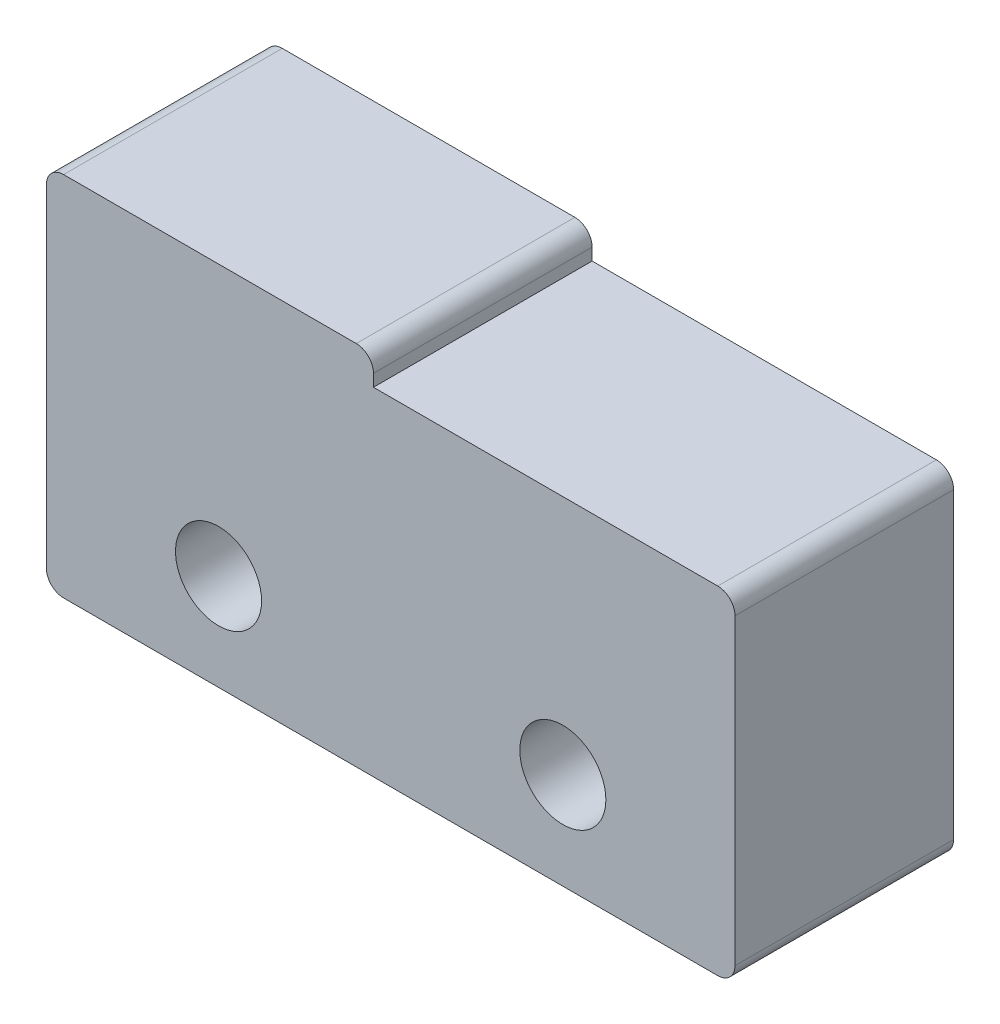
ISO-10303-21;
HEADER;
FILE_DESCRIPTION(('STEP AP214'),'2;1');
FILE_NAME('part.step','',(''),(''),'','','');
FILE_SCHEMA(('AUTOMOTIVE_DESIGN { 1 0 10303 214 1 1 1 1 }'));
ENDSEC;
DATA;
#1=APPLICATION_CONTEXT('core data for automotive mechanical design processes');
#2=APPLICATION_PROTOCOL_DEFINITION('international standard','automotive_design',2000,#1);
#3=PRODUCT_CONTEXT('',#1,'mechanical');
#4=PRODUCT('Part','Part','',(#3));
#5=PRODUCT_RELATED_PRODUCT_CATEGORY('part','',(#4));
#6=PRODUCT_DEFINITION_FORMATION('','',#4);
#7=PRODUCT_DEFINITION_CONTEXT('part definition',#1,'design');
#8=PRODUCT_DEFINITION('design','',#6,#7);
#9=PRODUCT_DEFINITION_SHAPE('','',#8);
#10=(LENGTH_UNIT() NAMED_UNIT(*) SI_UNIT(.MILLI.,.METRE.));
#11=(NAMED_UNIT(*) PLANE_ANGLE_UNIT() SI_UNIT($,.RADIAN.));
#12=(NAMED_UNIT(*) SI_UNIT($,.STERADIAN.) SOLID_ANGLE_UNIT());
#13=UNCERTAINTY_MEASURE_WITH_UNIT(LENGTH_MEASURE(1.E-05),#10,'distance_accuracy_value','');
#14=(GEOMETRIC_REPRESENTATION_CONTEXT(3) GLOBAL_UNCERTAINTY_ASSIGNED_CONTEXT((#13)) GLOBAL_UNIT_ASSIGNED_CONTEXT((#10,
#11,#12)) REPRESENTATION_CONTEXT('',''));
#15=CARTESIAN_POINT('',(0.,0.,0.));
#16=DIRECTION('',(0.,0.,1.));
#17=DIRECTION('',(1.,0.,0.));
#18=AXIS2_PLACEMENT_3D('',#15,#16,#17);
#19=CARTESIAN_POINT('',(0.,0.,6.35));
#20=DIRECTION('',(0.,0.,-1.));
#21=DIRECTION('',(-1.,0.,0.));
#22=AXIS2_PLACEMENT_3D('',#19,#20,#21);
#23=PLANE('',#22);
#24=CARTESIAN_POINT('',(-5.,-2.2,6.35));
#25=DIRECTION('',(0.,0.,1.));
#26=DIRECTION('',(1.,0.,0.));
#27=AXIS2_PLACEMENT_3D('',#24,#25,#26);
#28=CIRCLE('',#27,1.25);
#29=CARTESIAN_POINT('',(-3.75,-2.2,6.35));
#30=VERTEX_POINT('',#29);
#31=EDGE_CURVE('E149',#30,#30,#28,.T.);
#32=ORIENTED_EDGE('',*,*,#31,.F.);
#33=EDGE_LOOP('',(#32));
#34=FACE_BOUND('',#33,.T.);
#35=DIRECTION('',(1.,0.,0.));
#36=VECTOR('',#35,1.);
#37=CARTESIAN_POINT('',(10.,-5.,6.35));
#38=LINE('',#37,#36);
#39=CARTESIAN_POINT('',(-9.5,-5.,6.35));
#40=VERTEX_POINT('',#39);
#41=CARTESIAN_POINT('',(9.5,-5.,6.35));
#42=VERTEX_POINT('',#41);
#43=EDGE_CURVE('E216',#40,#42,#38,.T.);
#44=ORIENTED_EDGE('',*,*,#43,.T.);
#45=CARTESIAN_POINT('',(9.5,-4.5,6.35));
#46=DIRECTION('',(0.,0.,-1.));
#47=DIRECTION('',(-1.,0.,0.));
#48=AXIS2_PLACEMENT_3D('',#45,#46,#47);
#49=CIRCLE('',#48,0.5);
#50=CARTESIAN_POINT('',(10.,-4.5,6.35));
#51=VERTEX_POINT('',#50);
#52=EDGE_CURVE('E186',#42,#51,#49,.F.);
#53=ORIENTED_EDGE('',*,*,#52,.T.);
#54=DIRECTION('',(0.,1.,0.));
#55=VECTOR('',#54,1.);
#56=CARTESIAN_POINT('',(10.,4.8,6.35));
#57=LINE('',#56,#55);
#58=CARTESIAN_POINT('',(10.,4.3,6.35));
#59=VERTEX_POINT('',#58);
#60=EDGE_CURVE('E126',#51,#59,#57,.T.);
#61=ORIENTED_EDGE('',*,*,#60,.T.);
#62=CARTESIAN_POINT('',(9.5,4.3,6.35));
#63=DIRECTION('',(0.,0.,-1.));
#64=DIRECTION('',(-1.,0.,0.));
#65=AXIS2_PLACEMENT_3D('',#62,#63,#64);
#66=CIRCLE('',#65,0.5);
#67=CARTESIAN_POINT('',(9.5,4.8,6.35));
#68=VERTEX_POINT('',#67);
#69=EDGE_CURVE('E122',#59,#68,#66,.F.);
#70=ORIENTED_EDGE('',*,*,#69,.T.);
#71=DIRECTION('',(-1.,0.,0.));
#72=VECTOR('',#71,1.);
#73=CARTESIAN_POINT('',(10.,4.8,6.35));
#74=LINE('',#73,#72);
#75=CARTESIAN_POINT('',(-0.5,4.8,6.35));
#76=VERTEX_POINT('',#75);
#77=EDGE_CURVE('E114',#68,#76,#74,.T.);
#78=ORIENTED_EDGE('',*,*,#77,.T.);
#79=DIRECTION('',(0.,1.,0.));
#80=VECTOR('',#79,1.);
#81=CARTESIAN_POINT('',(-0.5,5.65,6.35));
#82=LINE('',#81,#80);
#83=CARTESIAN_POINT('',(-0.5,5.15,6.35));
#84=VERTEX_POINT('',#83);
#85=EDGE_CURVE('E119',#76,#84,#82,.T.);
#86=ORIENTED_EDGE('',*,*,#85,.T.);
#87=CARTESIAN_POINT('',(-1.,5.15,6.35));
#88=DIRECTION('',(0.,0.,-1.));
#89=DIRECTION('',(-1.,0.,0.));
#90=AXIS2_PLACEMENT_3D('',#87,#88,#89);
#91=CIRCLE('',#90,0.5);
#92=CARTESIAN_POINT('',(-1.,5.65,6.35));
#93=VERTEX_POINT('',#92);
#94=EDGE_CURVE('E54',#84,#93,#91,.F.);
#95=ORIENTED_EDGE('',*,*,#94,.T.);
#96=DIRECTION('',(-1.,0.,0.));
#97=VECTOR('',#96,1.);
#98=CARTESIAN_POINT('',(-0.5,5.65,6.35));
#99=LINE('',#98,#97);
#100=CARTESIAN_POINT('',(-9.5,5.65,6.35));
#101=VERTEX_POINT('',#100);
#102=EDGE_CURVE('E137',#93,#101,#99,.T.);
#103=ORIENTED_EDGE('',*,*,#102,.T.);
#104=CARTESIAN_POINT('',(-9.5,5.15,6.35));
#105=DIRECTION('',(0.,0.,-1.));
#106=DIRECTION('',(-1.,0.,0.));
#107=AXIS2_PLACEMENT_3D('',#104,#105,#106);
#108=CIRCLE('',#107,0.5);
#109=CARTESIAN_POINT('',(-10.,5.15,6.35));
#110=VERTEX_POINT('',#109);
#111=EDGE_CURVE('E181',#101,#110,#108,.F.);
#112=ORIENTED_EDGE('',*,*,#111,.T.);
#113=DIRECTION('',(0.,-1.,0.));
#114=VECTOR('',#113,1.);
#115=CARTESIAN_POINT('',(-10.,5.65,6.35));
#116=LINE('',#115,#114);
#117=CARTESIAN_POINT('',(-10.,-4.5,6.35));
#118=VERTEX_POINT('',#117);
#119=EDGE_CURVE('E159',#110,#118,#116,.T.);
#120=ORIENTED_EDGE('',*,*,#119,.T.);
#121=CARTESIAN_POINT('',(-9.5,-4.5,6.35));
#122=DIRECTION('',(0.,0.,-1.));
#123=DIRECTION('',(-1.,0.,0.));
#124=AXIS2_PLACEMENT_3D('',#121,#122,#123);
#125=CIRCLE('',#124,0.5);
#126=EDGE_CURVE('E183',#118,#40,#125,.F.);
#127=ORIENTED_EDGE('',*,*,#126,.T.);
#128=EDGE_LOOP('',(#44,#53,#61,#70,#78,#86,#95,#103,#112,#120,#127));
#129=FACE_BOUND('',#128,.T.);
#130=CARTESIAN_POINT('',(5.,-2.2,6.35));
#131=DIRECTION('',(0.,0.,1.));
#132=DIRECTION('',(1.,0.,0.));
#133=AXIS2_PLACEMENT_3D('',#130,#131,#132);
#134=CIRCLE('',#133,1.25);
#135=CARTESIAN_POINT('',(6.25,-2.2,6.35));
#136=VERTEX_POINT('',#135);
#137=EDGE_CURVE('E369',#136,#136,#134,.T.);
#138=ORIENTED_EDGE('',*,*,#137,.F.);
#139=EDGE_LOOP('',(#138));
#140=FACE_BOUND('',#139,.T.);
#141=ADVANCED_FACE('F33',(#34,#129,#140),#23,.F.);
#142=CARTESIAN_POINT('',(0.,0.,0.));
#143=DIRECTION('',(0.,0.,-1.));
#144=DIRECTION('',(-1.,0.,0.));
#145=AXIS2_PLACEMENT_3D('',#142,#143,#144);
#146=PLANE('',#145);
#147=CARTESIAN_POINT('',(-5.,-2.2,0.));
#148=DIRECTION('',(0.,0.,1.));
#149=DIRECTION('',(1.,0.,0.));
#150=AXIS2_PLACEMENT_3D('',#147,#148,#149);
#151=CIRCLE('',#150,1.25);
#152=CARTESIAN_POINT('',(-3.75,-2.2,0.));
#153=VERTEX_POINT('',#152);
#154=EDGE_CURVE('E220',#153,#153,#151,.T.);
#155=ORIENTED_EDGE('',*,*,#154,.T.);
#156=EDGE_LOOP('',(#155));
#157=FACE_BOUND('',#156,.T.);
#158=DIRECTION('',(0.,1.,0.));
#159=VECTOR('',#158,1.);
#160=CARTESIAN_POINT('',(10.,4.8,0.));
#161=LINE('',#160,#159);
#162=CARTESIAN_POINT('',(10.,-4.5,0.));
#163=VERTEX_POINT('',#162);
#164=CARTESIAN_POINT('',(10.,4.3,0.));
#165=VERTEX_POINT('',#164);
#166=EDGE_CURVE('E152',#163,#165,#161,.T.);
#167=ORIENTED_EDGE('',*,*,#166,.F.);
#168=CARTESIAN_POINT('',(9.5,-4.5,0.));
#169=DIRECTION('',(0.,0.,-1.));
#170=DIRECTION('',(-1.,0.,0.));
#171=AXIS2_PLACEMENT_3D('',#168,#169,#170);
#172=CIRCLE('',#171,0.5);
#173=CARTESIAN_POINT('',(9.5,-5.,0.));
#174=VERTEX_POINT('',#173);
#175=EDGE_CURVE('E173',#163,#174,#172,.T.);
#176=ORIENTED_EDGE('',*,*,#175,.T.);
#177=DIRECTION('',(1.,0.,0.));
#178=VECTOR('',#177,1.);
#179=CARTESIAN_POINT('',(10.,-5.,0.));
#180=LINE('',#179,#178);
#181=CARTESIAN_POINT('',(-9.5,-5.,0.));
#182=VERTEX_POINT('',#181);
#183=EDGE_CURVE('E148',#182,#174,#180,.T.);
#184=ORIENTED_EDGE('',*,*,#183,.F.);
#185=CARTESIAN_POINT('',(-9.5,-4.5,0.));
#186=DIRECTION('',(0.,0.,-1.));
#187=DIRECTION('',(-1.,0.,0.));
#188=AXIS2_PLACEMENT_3D('',#185,#186,#187);
#189=CIRCLE('',#188,0.5);
#190=CARTESIAN_POINT('',(-10.,-4.5,0.));
#191=VERTEX_POINT('',#190);
#192=EDGE_CURVE('E169',#182,#191,#189,.T.);
#193=ORIENTED_EDGE('',*,*,#192,.T.);
#194=DIRECTION('',(0.,-1.,0.));
#195=VECTOR('',#194,1.);
#196=CARTESIAN_POINT('',(-10.,5.65,0.));
#197=LINE('',#196,#195);
#198=CARTESIAN_POINT('',(-10.,5.15,0.));
#199=VERTEX_POINT('',#198);
#200=EDGE_CURVE('E145',#199,#191,#197,.T.);
#201=ORIENTED_EDGE('',*,*,#200,.F.);
#202=CARTESIAN_POINT('',(-9.5,5.15,0.));
#203=DIRECTION('',(0.,0.,-1.));
#204=DIRECTION('',(-1.,0.,0.));
#205=AXIS2_PLACEMENT_3D('',#202,#203,#204);
#206=CIRCLE('',#205,0.5);
#207=CARTESIAN_POINT('',(-9.5,5.65,0.));
#208=VERTEX_POINT('',#207);
#209=EDGE_CURVE('E167',#199,#208,#206,.T.);
#210=ORIENTED_EDGE('',*,*,#209,.T.);
#211=DIRECTION('',(-1.,0.,0.));
#212=VECTOR('',#211,1.);
#213=CARTESIAN_POINT('',(-0.5,5.65,0.));
#214=LINE('',#213,#212);
#215=CARTESIAN_POINT('',(-1.,5.65,0.));
#216=VERTEX_POINT('',#215);
#217=EDGE_CURVE('E158',#216,#208,#214,.T.);
#218=ORIENTED_EDGE('',*,*,#217,.F.);
#219=CARTESIAN_POINT('',(-1.,5.15,0.));
#220=DIRECTION('',(0.,0.,-1.));
#221=DIRECTION('',(-1.,0.,0.));
#222=AXIS2_PLACEMENT_3D('',#219,#220,#221);
#223=CIRCLE('',#222,0.5);
#224=CARTESIAN_POINT('',(-0.5,5.15,0.));
#225=VERTEX_POINT('',#224);
#226=EDGE_CURVE('E165',#216,#225,#223,.T.);
#227=ORIENTED_EDGE('',*,*,#226,.T.);
#228=DIRECTION('',(0.,1.,0.));
#229=VECTOR('',#228,1.);
#230=CARTESIAN_POINT('',(-0.5,5.65,0.));
#231=LINE('',#230,#229);
#232=CARTESIAN_POINT('',(-0.5,4.8,0.));
#233=VERTEX_POINT('',#232);
#234=EDGE_CURVE('E156',#233,#225,#231,.T.);
#235=ORIENTED_EDGE('',*,*,#234,.F.);
#236=DIRECTION('',(-1.,0.,0.));
#237=VECTOR('',#236,1.);
#238=CARTESIAN_POINT('',(10.,4.8,0.));
#239=LINE('',#238,#237);
#240=CARTESIAN_POINT('',(9.5,4.8,0.));
#241=VERTEX_POINT('',#240);
#242=EDGE_CURVE('E132',#241,#233,#239,.T.);
#243=ORIENTED_EDGE('',*,*,#242,.F.);
#244=CARTESIAN_POINT('',(9.5,4.3,0.));
#245=DIRECTION('',(0.,0.,-1.));
#246=DIRECTION('',(-1.,0.,0.));
#247=AXIS2_PLACEMENT_3D('',#244,#245,#246);
#248=CIRCLE('',#247,0.5);
#249=EDGE_CURVE('E171',#241,#165,#248,.T.);
#250=ORIENTED_EDGE('',*,*,#249,.T.);
#251=EDGE_LOOP('',(#167,#176,#184,#193,#201,#210,#218,#227,#235,#243,#250));
#252=FACE_BOUND('',#251,.T.);
#253=CARTESIAN_POINT('',(5.,-2.2,0.));
#254=DIRECTION('',(0.,0.,1.));
#255=DIRECTION('',(1.,0.,0.));
#256=AXIS2_PLACEMENT_3D('',#253,#254,#255);
#257=CIRCLE('',#256,1.25);
#258=CARTESIAN_POINT('',(6.25,-2.2,0.));
#259=VERTEX_POINT('',#258);
#260=EDGE_CURVE('E371',#259,#259,#257,.T.);
#261=ORIENTED_EDGE('',*,*,#260,.T.);
#262=EDGE_LOOP('',(#261));
#263=FACE_BOUND('',#262,.T.);
#264=ADVANCED_FACE('F203',(#157,#252,#263),#146,.T.);
#265=CARTESIAN_POINT('',(-10.,5.65,6.35));
#266=DIRECTION('',(1.,0.,0.));
#267=DIRECTION('',(0.,0.,-1.));
#268=AXIS2_PLACEMENT_3D('',#265,#266,#267);
#269=PLANE('',#268);
#270=ORIENTED_EDGE('',*,*,#200,.T.);
#271=DIRECTION('',(0.,0.,-1.));
#272=VECTOR('',#271,1.);
#273=CARTESIAN_POINT('',(-10.,-4.5,6.35));
#274=LINE('',#273,#272);
#275=EDGE_CURVE('E193',#191,#118,#274,.F.);
#276=ORIENTED_EDGE('',*,*,#275,.T.);
#277=ORIENTED_EDGE('',*,*,#119,.F.);
#278=DIRECTION('',(0.,0.,-1.));
#279=VECTOR('',#278,1.);
#280=CARTESIAN_POINT('',(-10.,5.15,6.35));
#281=LINE('',#280,#279);
#282=EDGE_CURVE('E190',#110,#199,#281,.T.);
#283=ORIENTED_EDGE('',*,*,#282,.T.);
#284=EDGE_LOOP('',(#270,#276,#277,#283));
#285=FACE_BOUND('',#284,.T.);
#286=ADVANCED_FACE('F212',(#285),#269,.F.);
#287=CARTESIAN_POINT('',(10.,-5.,6.35));
#288=DIRECTION('',(0.,1.,0.));
#289=DIRECTION('',(-1.,0.,0.));
#290=AXIS2_PLACEMENT_3D('',#287,#288,#289);
#291=PLANE('',#290);
#292=ORIENTED_EDGE('',*,*,#183,.T.);
#293=DIRECTION('',(0.,0.,-1.));
#294=VECTOR('',#293,1.);
#295=CARTESIAN_POINT('',(9.5,-5.,6.35));
#296=LINE('',#295,#294);
#297=EDGE_CURVE('E178',#174,#42,#296,.F.);
#298=ORIENTED_EDGE('',*,*,#297,.T.);
#299=ORIENTED_EDGE('',*,*,#43,.F.);
#300=DIRECTION('',(0.,0.,-1.));
#301=VECTOR('',#300,1.);
#302=CARTESIAN_POINT('',(-9.5,-5.,6.35));
#303=LINE('',#302,#301);
#304=EDGE_CURVE('E175',#40,#182,#303,.T.);
#305=ORIENTED_EDGE('',*,*,#304,.T.);
#306=EDGE_LOOP('',(#292,#298,#299,#305));
#307=FACE_BOUND('',#306,.T.);
#308=ADVANCED_FACE('F256',(#307),#291,.F.);
#309=CARTESIAN_POINT('',(10.,4.8,6.35));
#310=DIRECTION('',(-1.,0.,0.));
#311=DIRECTION('',(0.,0.,1.));
#312=AXIS2_PLACEMENT_3D('',#309,#310,#311);
#313=PLANE('',#312);
#314=ORIENTED_EDGE('',*,*,#60,.F.);
#315=DIRECTION('',(0.,0.,-1.));
#316=VECTOR('',#315,1.);
#317=CARTESIAN_POINT('',(10.,-4.5,6.35));
#318=LINE('',#317,#316);
#319=EDGE_CURVE('E162',#51,#163,#318,.T.);
#320=ORIENTED_EDGE('',*,*,#319,.T.);
#321=ORIENTED_EDGE('',*,*,#166,.T.);
#322=DIRECTION('',(0.,0.,-1.));
#323=VECTOR('',#322,1.);
#324=CARTESIAN_POINT('',(10.,4.3,6.35));
#325=LINE('',#324,#323);
#326=EDGE_CURVE('E136',#165,#59,#325,.F.);
#327=ORIENTED_EDGE('',*,*,#326,.T.);
#328=EDGE_LOOP('',(#314,#320,#321,#327));
#329=FACE_BOUND('',#328,.T.);
#330=ADVANCED_FACE('F253',(#329),#313,.F.);
#331=CARTESIAN_POINT('',(10.,4.8,6.35));
#332=DIRECTION('',(0.,-1.,0.));
#333=DIRECTION('',(0.,0.,-1.));
#334=AXIS2_PLACEMENT_3D('',#331,#332,#333);
#335=PLANE('',#334);
#336=ORIENTED_EDGE('',*,*,#77,.F.);
#337=DIRECTION('',(0.,0.,-1.));
#338=VECTOR('',#337,1.);
#339=CARTESIAN_POINT('',(9.5,4.8,6.35));
#340=LINE('',#339,#338);
#341=EDGE_CURVE('E188',#68,#241,#340,.T.);
#342=ORIENTED_EDGE('',*,*,#341,.T.);
#343=ORIENTED_EDGE('',*,*,#242,.T.);
#344=DIRECTION('',(0.,0.,-1.));
#345=VECTOR('',#344,1.);
#346=CARTESIAN_POINT('',(-0.5,4.8,6.35));
#347=LINE('',#346,#345);
#348=EDGE_CURVE('E129',#76,#233,#347,.T.);
#349=ORIENTED_EDGE('',*,*,#348,.F.);
#350=EDGE_LOOP('',(#336,#342,#343,#349));
#351=FACE_BOUND('',#350,.T.);
#352=ADVANCED_FACE('F130',(#351),#335,.F.);
#353=CARTESIAN_POINT('',(-0.5,5.65,6.35));
#354=DIRECTION('',(-1.,0.,0.));
#355=DIRECTION('',(0.,0.,1.));
#356=AXIS2_PLACEMENT_3D('',#353,#354,#355);
#357=PLANE('',#356);
#358=ORIENTED_EDGE('',*,*,#234,.T.);
#359=DIRECTION('',(0.,0.,-1.));
#360=VECTOR('',#359,1.);
#361=CARTESIAN_POINT('',(-0.5,5.15,6.35));
#362=LINE('',#361,#360);
#363=EDGE_CURVE('E11',#225,#84,#362,.F.);
#364=ORIENTED_EDGE('',*,*,#363,.T.);
#365=ORIENTED_EDGE('',*,*,#85,.F.);
#366=ORIENTED_EDGE('',*,*,#348,.T.);
#367=EDGE_LOOP('',(#358,#364,#365,#366));
#368=FACE_BOUND('',#367,.T.);
#369=ADVANCED_FACE('F139',(#368),#357,.F.);
#370=CARTESIAN_POINT('',(-0.5,5.65,6.35));
#371=DIRECTION('',(0.,-1.,0.));
#372=DIRECTION('',(0.,0.,-1.));
#373=AXIS2_PLACEMENT_3D('',#370,#371,#372);
#374=PLANE('',#373);
#375=ORIENTED_EDGE('',*,*,#217,.T.);
#376=DIRECTION('',(0.,0.,-1.));
#377=VECTOR('',#376,1.);
#378=CARTESIAN_POINT('',(-9.5,5.65,6.35));
#379=LINE('',#378,#377);
#380=EDGE_CURVE('E41',#208,#101,#379,.F.);
#381=ORIENTED_EDGE('',*,*,#380,.T.);
#382=ORIENTED_EDGE('',*,*,#102,.F.);
#383=DIRECTION('',(0.,0.,-1.));
#384=VECTOR('',#383,1.);
#385=CARTESIAN_POINT('',(-1.,5.65,6.35));
#386=LINE('',#385,#384);
#387=EDGE_CURVE('E195',#93,#216,#386,.T.);
#388=ORIENTED_EDGE('',*,*,#387,.T.);
#389=EDGE_LOOP('',(#375,#381,#382,#388));
#390=FACE_BOUND('',#389,.T.);
#391=ADVANCED_FACE('F199',(#390),#374,.F.);
#392=CARTESIAN_POINT('',(-5.,-2.2,6.35));
#393=DIRECTION('',(0.,0.,-1.));
#394=DIRECTION('',(-1.,0.,0.));
#395=AXIS2_PLACEMENT_3D('',#392,#393,#394);
#396=CYLINDRICAL_SURFACE('',#395,1.25);
#397=ORIENTED_EDGE('',*,*,#31,.T.);
#398=EDGE_LOOP('',(#397));
#399=FACE_BOUND('',#398,.T.);
#400=ORIENTED_EDGE('',*,*,#154,.F.);
#401=EDGE_LOOP('',(#400));
#402=FACE_BOUND('',#401,.T.);
#403=ADVANCED_FACE('F244',(#399,#402),#396,.F.);
#404=CARTESIAN_POINT('',(5.,-2.2,6.35));
#405=DIRECTION('',(0.,0.,-1.));
#406=DIRECTION('',(-1.,0.,0.));
#407=AXIS2_PLACEMENT_3D('',#404,#405,#406);
#408=CYLINDRICAL_SURFACE('',#407,1.25);
#409=ORIENTED_EDGE('',*,*,#137,.T.);
#410=EDGE_LOOP('',(#409));
#411=FACE_BOUND('',#410,.T.);
#412=ORIENTED_EDGE('',*,*,#260,.F.);
#413=EDGE_LOOP('',(#412));
#414=FACE_BOUND('',#413,.T.);
#415=ADVANCED_FACE('F265',(#411,#414),#408,.F.);
#416=CARTESIAN_POINT('',(9.5,-4.5,6.35));
#417=DIRECTION('',(0.,0.,-1.));
#418=DIRECTION('',(-1.,0.,0.));
#419=AXIS2_PLACEMENT_3D('',#416,#417,#418);
#420=CYLINDRICAL_SURFACE('',#419,0.5);
#421=ORIENTED_EDGE('',*,*,#52,.F.);
#422=ORIENTED_EDGE('',*,*,#297,.F.);
#423=ORIENTED_EDGE('',*,*,#175,.F.);
#424=ORIENTED_EDGE('',*,*,#319,.F.);
#425=EDGE_LOOP('',(#421,#422,#423,#424));
#426=FACE_BOUND('',#425,.T.);
#427=ADVANCED_FACE('F262',(#426),#420,.T.);
#428=CARTESIAN_POINT('',(9.5,4.3,6.35));
#429=DIRECTION('',(0.,0.,-1.));
#430=DIRECTION('',(-1.,0.,0.));
#431=AXIS2_PLACEMENT_3D('',#428,#429,#430);
#432=CYLINDRICAL_SURFACE('',#431,0.5);
#433=ORIENTED_EDGE('',*,*,#69,.F.);
#434=ORIENTED_EDGE('',*,*,#326,.F.);
#435=ORIENTED_EDGE('',*,*,#249,.F.);
#436=ORIENTED_EDGE('',*,*,#341,.F.);
#437=EDGE_LOOP('',(#433,#434,#435,#436));
#438=FACE_BOUND('',#437,.T.);
#439=ADVANCED_FACE('F228',(#438),#432,.T.);
#440=CARTESIAN_POINT('',(-9.5,-4.5,6.35));
#441=DIRECTION('',(0.,0.,-1.));
#442=DIRECTION('',(-1.,0.,0.));
#443=AXIS2_PLACEMENT_3D('',#440,#441,#442);
#444=CYLINDRICAL_SURFACE('',#443,0.5);
#445=ORIENTED_EDGE('',*,*,#126,.F.);
#446=ORIENTED_EDGE('',*,*,#275,.F.);
#447=ORIENTED_EDGE('',*,*,#192,.F.);
#448=ORIENTED_EDGE('',*,*,#304,.F.);
#449=EDGE_LOOP('',(#445,#446,#447,#448));
#450=FACE_BOUND('',#449,.T.);
#451=ADVANCED_FACE('F233',(#450),#444,.T.);
#452=CARTESIAN_POINT('',(-9.5,5.15,6.35));
#453=DIRECTION('',(0.,0.,-1.));
#454=DIRECTION('',(-1.,0.,0.));
#455=AXIS2_PLACEMENT_3D('',#452,#453,#454);
#456=CYLINDRICAL_SURFACE('',#455,0.5);
#457=ORIENTED_EDGE('',*,*,#111,.F.);
#458=ORIENTED_EDGE('',*,*,#380,.F.);
#459=ORIENTED_EDGE('',*,*,#209,.F.);
#460=ORIENTED_EDGE('',*,*,#282,.F.);
#461=EDGE_LOOP('',(#457,#458,#459,#460));
#462=FACE_BOUND('',#461,.T.);
#463=ADVANCED_FACE('F209',(#462),#456,.T.);
#464=CARTESIAN_POINT('',(-1.,5.15,6.35));
#465=DIRECTION('',(0.,0.,-1.));
#466=DIRECTION('',(-1.,0.,0.));
#467=AXIS2_PLACEMENT_3D('',#464,#465,#466);
#468=CYLINDRICAL_SURFACE('',#467,0.5);
#469=ORIENTED_EDGE('',*,*,#94,.F.);
#470=ORIENTED_EDGE('',*,*,#363,.F.);
#471=ORIENTED_EDGE('',*,*,#226,.F.);
#472=ORIENTED_EDGE('',*,*,#387,.F.);
#473=EDGE_LOOP('',(#469,#470,#471,#472));
#474=FACE_BOUND('',#473,.T.);
#475=ADVANCED_FACE('F35',(#474),#468,.T.);
#476=CLOSED_SHELL('',(#141,#264,#286,#308,#330,#352,#369,#391,#403,#415,#427,#439,#451,#463,#475));
#477=MANIFOLD_SOLID_BREP('B2',#476);
#478=ADVANCED_BREP_SHAPE_REPRESENTATION('',(#18,#477),#14);
#479=SHAPE_DEFINITION_REPRESENTATION(#9,#478);
ENDSEC;
END-ISO-10303-21;
